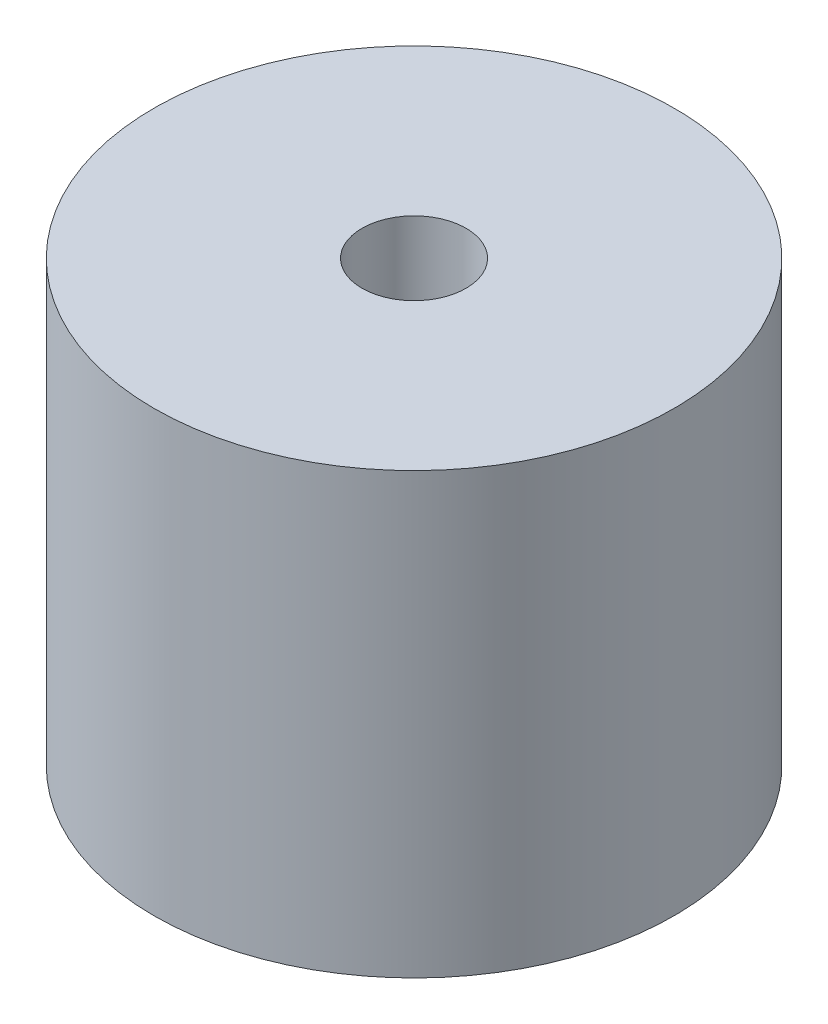
ISO-10303-21;
HEADER;
FILE_DESCRIPTION(('STEP AP214'),'2;1');
FILE_NAME('part.step','',(''),(''),'','','');
FILE_SCHEMA(('AUTOMOTIVE_DESIGN { 1 0 10303 214 1 1 1 1 }'));
ENDSEC;
DATA;
#1=APPLICATION_CONTEXT('core data for automotive mechanical design processes');
#2=APPLICATION_PROTOCOL_DEFINITION('international standard','automotive_design',2000,#1);
#3=PRODUCT_CONTEXT('',#1,'mechanical');
#4=PRODUCT('Part','Part','',(#3));
#5=PRODUCT_RELATED_PRODUCT_CATEGORY('part','',(#4));
#6=PRODUCT_DEFINITION_FORMATION('','',#4);
#7=PRODUCT_DEFINITION_CONTEXT('part definition',#1,'design');
#8=PRODUCT_DEFINITION('design','',#6,#7);
#9=PRODUCT_DEFINITION_SHAPE('','',#8);
#10=(LENGTH_UNIT() NAMED_UNIT(*) SI_UNIT(.MILLI.,.METRE.));
#11=(NAMED_UNIT(*) PLANE_ANGLE_UNIT() SI_UNIT($,.RADIAN.));
#12=(NAMED_UNIT(*) SI_UNIT($,.STERADIAN.) SOLID_ANGLE_UNIT());
#13=UNCERTAINTY_MEASURE_WITH_UNIT(LENGTH_MEASURE(1.E-05),#10,'distance_accuracy_value','');
#14=(GEOMETRIC_REPRESENTATION_CONTEXT(3) GLOBAL_UNCERTAINTY_ASSIGNED_CONTEXT((#13)) GLOBAL_UNIT_ASSIGNED_CONTEXT((#10,
#11,#12)) REPRESENTATION_CONTEXT('',''));
#15=CARTESIAN_POINT('',(0.,0.,0.));
#16=DIRECTION('',(0.,0.,1.));
#17=DIRECTION('',(1.,0.,0.));
#18=AXIS2_PLACEMENT_3D('',#15,#16,#17);
#19=CARTESIAN_POINT('',(0.,13.4112,0.));
#20=DIRECTION('',(0.,1.,0.));
#21=DIRECTION('',(0.,0.,1.));
#22=AXIS2_PLACEMENT_3D('',#19,#20,#21);
#23=PLANE('',#22);
#24=CARTESIAN_POINT('',(0.,13.4112,0.));
#25=DIRECTION('',(0.,1.,0.));
#26=DIRECTION('',(0.,0.,1.));
#27=AXIS2_PLACEMENT_3D('',#24,#25,#26);
#28=CIRCLE('',#27,7.9375);
#29=CARTESIAN_POINT('',(0.,13.4112,7.9375));
#30=VERTEX_POINT('',#29);
#31=EDGE_CURVE('E10',#30,#30,#28,.T.);
#32=ORIENTED_EDGE('',*,*,#31,.T.);
#33=EDGE_LOOP('',(#32));
#34=FACE_BOUND('',#33,.T.);
#35=CARTESIAN_POINT('',(0.,13.4112,0.));
#36=DIRECTION('',(0.,1.,0.));
#37=DIRECTION('',(0.,0.,1.));
#38=AXIS2_PLACEMENT_3D('',#35,#36,#37);
#39=CIRCLE('',#38,1.5875);
#40=CARTESIAN_POINT('',(0.,13.4112,1.5875));
#41=VERTEX_POINT('',#40);
#42=EDGE_CURVE('E42',#41,#41,#39,.T.);
#43=ORIENTED_EDGE('',*,*,#42,.F.);
#44=EDGE_LOOP('',(#43));
#45=FACE_BOUND('',#44,.T.);
#46=ADVANCED_FACE('F31',(#34,#45),#23,.T.);
#47=CARTESIAN_POINT('',(0.,0.,0.));
#48=DIRECTION('',(0.,1.,0.));
#49=DIRECTION('',(0.,0.,1.));
#50=AXIS2_PLACEMENT_3D('',#47,#48,#49);
#51=PLANE('',#50);
#52=CARTESIAN_POINT('',(0.,0.,0.));
#53=DIRECTION('',(0.,1.,0.));
#54=DIRECTION('',(0.,0.,1.));
#55=AXIS2_PLACEMENT_3D('',#52,#53,#54);
#56=CIRCLE('',#55,7.9375);
#57=CARTESIAN_POINT('',(0.,0.,7.9375));
#58=VERTEX_POINT('',#57);
#59=EDGE_CURVE('E35',#58,#58,#56,.T.);
#60=ORIENTED_EDGE('',*,*,#59,.F.);
#61=EDGE_LOOP('',(#60));
#62=FACE_BOUND('',#61,.T.);
#63=CARTESIAN_POINT('',(0.,0.,0.));
#64=DIRECTION('',(0.,1.,0.));
#65=DIRECTION('',(0.,0.,1.));
#66=AXIS2_PLACEMENT_3D('',#63,#64,#65);
#67=CIRCLE('',#66,1.5875);
#68=CARTESIAN_POINT('',(0.,0.,1.5875));
#69=VERTEX_POINT('',#68);
#70=EDGE_CURVE('E44',#69,#69,#67,.T.);
#71=ORIENTED_EDGE('',*,*,#70,.T.);
#72=EDGE_LOOP('',(#71));
#73=FACE_BOUND('',#72,.T.);
#74=ADVANCED_FACE('F54',(#62,#73),#51,.F.);
#75=CARTESIAN_POINT('',(0.,13.4112,0.));
#76=DIRECTION('',(0.,-1.,0.));
#77=DIRECTION('',(0.,0.,-1.));
#78=AXIS2_PLACEMENT_3D('',#75,#76,#77);
#79=CYLINDRICAL_SURFACE('',#78,7.9375);
#80=ORIENTED_EDGE('',*,*,#31,.F.);
#81=EDGE_LOOP('',(#80));
#82=FACE_BOUND('',#81,.T.);
#83=ORIENTED_EDGE('',*,*,#59,.T.);
#84=EDGE_LOOP('',(#83));
#85=FACE_BOUND('',#84,.T.);
#86=ADVANCED_FACE('F33',(#82,#85),#79,.T.);
#87=CARTESIAN_POINT('',(0.,13.4112,0.));
#88=DIRECTION('',(0.,-1.,0.));
#89=DIRECTION('',(0.,0.,-1.));
#90=AXIS2_PLACEMENT_3D('',#87,#88,#89);
#91=CYLINDRICAL_SURFACE('',#90,1.5875);
#92=ORIENTED_EDGE('',*,*,#42,.T.);
#93=EDGE_LOOP('',(#92));
#94=FACE_BOUND('',#93,.T.);
#95=ORIENTED_EDGE('',*,*,#70,.F.);
#96=EDGE_LOOP('',(#95));
#97=FACE_BOUND('',#96,.T.);
#98=ADVANCED_FACE('F50',(#94,#97),#91,.F.);
#99=CLOSED_SHELL('',(#46,#74,#86,#98));
#100=MANIFOLD_SOLID_BREP('B2',#99);
#101=ADVANCED_BREP_SHAPE_REPRESENTATION('',(#18,#100),#14);
#102=SHAPE_DEFINITION_REPRESENTATION(#9,#101);
ENDSEC;
END-ISO-10303-21;
